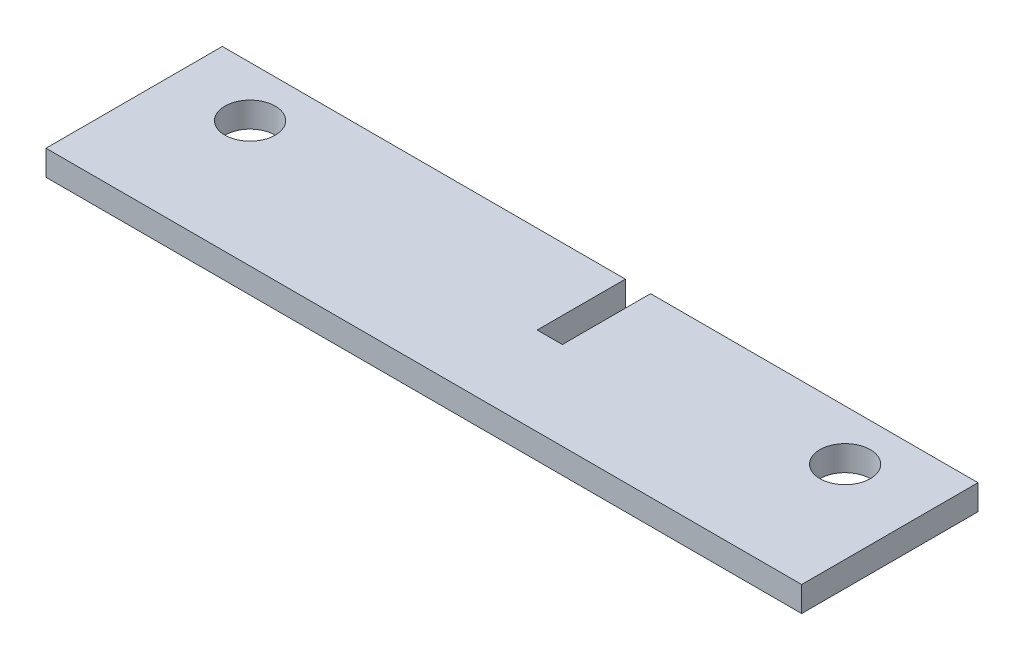
ISO-10303-21;
HEADER;
FILE_DESCRIPTION(('STEP AP214'),'2;1');
FILE_NAME('part.step','',(''),(''),'','','');
FILE_SCHEMA(('AUTOMOTIVE_DESIGN { 1 0 10303 214 1 1 1 1 }'));
ENDSEC;
DATA;
#1=APPLICATION_CONTEXT('core data for automotive mechanical design processes');
#2=APPLICATION_PROTOCOL_DEFINITION('international standard','automotive_design',2000,#1);
#3=PRODUCT_CONTEXT('',#1,'mechanical');
#4=PRODUCT('Part','Part','',(#3));
#5=PRODUCT_RELATED_PRODUCT_CATEGORY('part','',(#4));
#6=PRODUCT_DEFINITION_FORMATION('','',#4);
#7=PRODUCT_DEFINITION_CONTEXT('part definition',#1,'design');
#8=PRODUCT_DEFINITION('design','',#6,#7);
#9=PRODUCT_DEFINITION_SHAPE('','',#8);
#10=(LENGTH_UNIT() NAMED_UNIT(*) SI_UNIT(.MILLI.,.METRE.));
#11=(NAMED_UNIT(*) PLANE_ANGLE_UNIT() SI_UNIT($,.RADIAN.));
#12=(NAMED_UNIT(*) SI_UNIT($,.STERADIAN.) SOLID_ANGLE_UNIT());
#13=UNCERTAINTY_MEASURE_WITH_UNIT(LENGTH_MEASURE(1.E-05),#10,'distance_accuracy_value','');
#14=(GEOMETRIC_REPRESENTATION_CONTEXT(3) GLOBAL_UNCERTAINTY_ASSIGNED_CONTEXT((#13)) GLOBAL_UNIT_ASSIGNED_CONTEXT((#10,
#11,#12)) REPRESENTATION_CONTEXT('',''));
#15=CARTESIAN_POINT('',(0.,0.,0.));
#16=DIRECTION('',(0.,0.,1.));
#17=DIRECTION('',(1.,0.,0.));
#18=AXIS2_PLACEMENT_3D('',#15,#16,#17);
#19=CARTESIAN_POINT('',(0.,0.,249.6));
#20=DIRECTION('',(0.,0.,-1.));
#21=DIRECTION('',(-1.,0.,0.));
#22=AXIS2_PLACEMENT_3D('',#19,#20,#21);
#23=PLANE('',#22);
#24=DIRECTION('',(0.,1.,0.));
#25=VECTOR('',#24,1.);
#26=CARTESIAN_POINT('',(2476.5,115.8,249.6));
#27=LINE('',#26,#25);
#28=CARTESIAN_POINT('',(2476.5,115.8,249.6));
#29=VERTEX_POINT('',#28);
#30=CARTESIAN_POINT('',(2476.5,128.5,249.6));
#31=VERTEX_POINT('',#30);
#32=EDGE_CURVE('E142',#29,#31,#27,.T.);
#33=ORIENTED_EDGE('',*,*,#32,.T.);
#34=DIRECTION('',(-1.,0.,0.));
#35=VECTOR('',#34,1.);
#36=CARTESIAN_POINT('',(2260.6,128.5,249.6));
#37=LINE('',#36,#35);
#38=CARTESIAN_POINT('',(2641.6,128.5,249.6));
#39=VERTEX_POINT('',#38);
#40=EDGE_CURVE('E121',#39,#31,#37,.T.);
#41=ORIENTED_EDGE('',*,*,#40,.F.);
#42=DIRECTION('',(0.,1.,0.));
#43=VECTOR('',#42,1.);
#44=CARTESIAN_POINT('',(2641.6,115.8,249.6));
#45=LINE('',#44,#43);
#46=CARTESIAN_POINT('',(2641.6,115.8,249.6));
#47=VERTEX_POINT('',#46);
#48=EDGE_CURVE('E205',#47,#39,#45,.T.);
#49=ORIENTED_EDGE('',*,*,#48,.F.);
#50=DIRECTION('',(1.,0.,0.));
#51=VECTOR('',#50,1.);
#52=CARTESIAN_POINT('',(2260.6,115.8,249.6));
#53=LINE('',#52,#51);
#54=EDGE_CURVE('E181',#29,#47,#53,.T.);
#55=ORIENTED_EDGE('',*,*,#54,.F.);
#56=EDGE_LOOP('',(#33,#41,#49,#55));
#57=FACE_BOUND('',#56,.T.);
#58=ADVANCED_FACE('F43',(#57),#23,.T.);
#59=CARTESIAN_POINT('',(2260.6,115.8,249.6));
#60=DIRECTION('',(-1.,0.,0.));
#61=DIRECTION('',(0.,0.,1.));
#62=AXIS2_PLACEMENT_3D('',#59,#60,#61);
#63=PLANE('',#62);
#64=DIRECTION('',(0.,0.,1.));
#65=VECTOR('',#64,1.);
#66=CARTESIAN_POINT('',(2260.6,115.8,249.6));
#67=LINE('',#66,#65);
#68=CARTESIAN_POINT('',(2260.6,115.8,249.6));
#69=VERTEX_POINT('',#68);
#70=CARTESIAN_POINT('',(2260.6,115.8,338.5));
#71=VERTEX_POINT('',#70);
#72=EDGE_CURVE('E137',#69,#71,#67,.T.);
#73=ORIENTED_EDGE('',*,*,#72,.T.);
#74=DIRECTION('',(0.,-1.,0.));
#75=VECTOR('',#74,1.);
#76=CARTESIAN_POINT('',(2260.6,115.8,338.5));
#77=LINE('',#76,#75);
#78=CARTESIAN_POINT('',(2260.6,128.5,338.5));
#79=VERTEX_POINT('',#78);
#80=EDGE_CURVE('E128',#79,#71,#77,.T.);
#81=ORIENTED_EDGE('',*,*,#80,.F.);
#82=DIRECTION('',(0.,0.,1.));
#83=VECTOR('',#82,1.);
#84=CARTESIAN_POINT('',(2260.6,128.5,249.6));
#85=LINE('',#84,#83);
#86=CARTESIAN_POINT('',(2260.6,128.5,249.6));
#87=VERTEX_POINT('',#86);
#88=EDGE_CURVE('E114',#87,#79,#85,.T.);
#89=ORIENTED_EDGE('',*,*,#88,.F.);
#90=DIRECTION('',(0.,-1.,0.));
#91=VECTOR('',#90,1.);
#92=CARTESIAN_POINT('',(2260.6,115.8,249.6));
#93=LINE('',#92,#91);
#94=EDGE_CURVE('E126',#87,#69,#93,.T.);
#95=ORIENTED_EDGE('',*,*,#94,.T.);
#96=EDGE_LOOP('',(#73,#81,#89,#95));
#97=FACE_BOUND('',#96,.T.);
#98=ADVANCED_FACE('F125',(#97),#63,.T.);
#99=CARTESIAN_POINT('',(2260.6,128.5,249.6));
#100=DIRECTION('',(0.,1.,0.));
#101=DIRECTION('',(0.,0.,1.));
#102=AXIS2_PLACEMENT_3D('',#99,#100,#101);
#103=PLANE('',#102);
#104=CARTESIAN_POINT('',(2599.99999999996,128.5,275.));
#105=DIRECTION('',(0.,1.,0.));
#106=DIRECTION('',(0.,0.,1.));
#107=AXIS2_PLACEMENT_3D('',#104,#105,#106);
#108=CIRCLE('',#107,12.6999999999999);
#109=CARTESIAN_POINT('',(2599.99999999996,128.5,262.3));
#110=VERTEX_POINT('',#109);
#111=EDGE_CURVE('E136',#110,#110,#108,.F.);
#112=ORIENTED_EDGE('',*,*,#111,.T.);
#113=EDGE_LOOP('',(#112));
#114=FACE_BOUND('',#113,.T.);
#115=CARTESIAN_POINT('',(2299.99999999996,128.5,275.));
#116=DIRECTION('',(0.,1.,0.));
#117=DIRECTION('',(0.,0.,1.));
#118=AXIS2_PLACEMENT_3D('',#115,#116,#117);
#119=CIRCLE('',#118,12.6999999999999);
#120=CARTESIAN_POINT('',(2299.99999999996,128.5,262.3));
#121=VERTEX_POINT('',#120);
#122=EDGE_CURVE('E47',#121,#121,#119,.F.);
#123=ORIENTED_EDGE('',*,*,#122,.T.);
#124=EDGE_LOOP('',(#123));
#125=FACE_BOUND('',#124,.T.);
#126=DIRECTION('',(0.,0.,-1.));
#127=VECTOR('',#126,1.);
#128=CARTESIAN_POINT('',(2476.5,128.5,249.6));
#129=LINE('',#128,#127);
#130=CARTESIAN_POINT('',(2476.5,128.5,294.05));
#131=VERTEX_POINT('',#130);
#132=EDGE_CURVE('E150',#131,#31,#129,.T.);
#133=ORIENTED_EDGE('',*,*,#132,.F.);
#134=DIRECTION('',(1.,0.,0.));
#135=VECTOR('',#134,1.);
#136=CARTESIAN_POINT('',(2476.5,128.5,294.05));
#137=LINE('',#136,#135);
#138=CARTESIAN_POINT('',(2463.8,128.5,294.05));
#139=VERTEX_POINT('',#138);
#140=EDGE_CURVE('E165',#139,#131,#137,.T.);
#141=ORIENTED_EDGE('',*,*,#140,.F.);
#142=DIRECTION('',(0.,0.,1.));
#143=VECTOR('',#142,1.);
#144=CARTESIAN_POINT('',(2463.8,128.5,294.05));
#145=LINE('',#144,#143);
#146=CARTESIAN_POINT('',(2463.8,128.5,249.6));
#147=VERTEX_POINT('',#146);
#148=EDGE_CURVE('E54',#147,#139,#145,.T.);
#149=ORIENTED_EDGE('',*,*,#148,.F.);
#150=EDGE_CURVE('E110',#147,#87,#37,.T.);
#151=ORIENTED_EDGE('',*,*,#150,.T.);
#152=ORIENTED_EDGE('',*,*,#88,.T.);
#153=DIRECTION('',(-1.,0.,0.));
#154=VECTOR('',#153,1.);
#155=CARTESIAN_POINT('',(2260.6,128.5,338.5));
#156=LINE('',#155,#154);
#157=CARTESIAN_POINT('',(2641.6,128.5,338.5));
#158=VERTEX_POINT('',#157);
#159=EDGE_CURVE('E147',#158,#79,#156,.T.);
#160=ORIENTED_EDGE('',*,*,#159,.F.);
#161=DIRECTION('',(0.,0.,1.));
#162=VECTOR('',#161,1.);
#163=CARTESIAN_POINT('',(2641.6,128.5,249.6));
#164=LINE('',#163,#162);
#165=EDGE_CURVE('E210',#39,#158,#164,.T.);
#166=ORIENTED_EDGE('',*,*,#165,.F.);
#167=ORIENTED_EDGE('',*,*,#40,.T.);
#168=EDGE_LOOP('',(#133,#141,#149,#151,#152,#160,#166,#167));
#169=FACE_BOUND('',#168,.T.);
#170=ADVANCED_FACE('F45',(#114,#125,#169),#103,.T.);
#171=CARTESIAN_POINT('',(2641.6,115.8,249.6));
#172=DIRECTION('',(1.,0.,0.));
#173=DIRECTION('',(0.,0.,-1.));
#174=AXIS2_PLACEMENT_3D('',#171,#172,#173);
#175=PLANE('',#174);
#176=ORIENTED_EDGE('',*,*,#165,.T.);
#177=DIRECTION('',(0.,1.,0.));
#178=VECTOR('',#177,1.);
#179=CARTESIAN_POINT('',(2641.6,115.8,338.5));
#180=LINE('',#179,#178);
#181=CARTESIAN_POINT('',(2641.6,115.8,338.5));
#182=VERTEX_POINT('',#181);
#183=EDGE_CURVE('E151',#182,#158,#180,.T.);
#184=ORIENTED_EDGE('',*,*,#183,.F.);
#185=DIRECTION('',(0.,0.,1.));
#186=VECTOR('',#185,1.);
#187=CARTESIAN_POINT('',(2641.6,115.8,249.6));
#188=LINE('',#187,#186);
#189=EDGE_CURVE('E191',#47,#182,#188,.T.);
#190=ORIENTED_EDGE('',*,*,#189,.F.);
#191=ORIENTED_EDGE('',*,*,#48,.T.);
#192=EDGE_LOOP('',(#176,#184,#190,#191));
#193=FACE_BOUND('',#192,.T.);
#194=ADVANCED_FACE('F204',(#193),#175,.T.);
#195=CARTESIAN_POINT('',(2260.6,115.8,249.6));
#196=DIRECTION('',(0.,-1.,0.));
#197=DIRECTION('',(0.,0.,-1.));
#198=AXIS2_PLACEMENT_3D('',#195,#196,#197);
#199=PLANE('',#198);
#200=CARTESIAN_POINT('',(2599.99999999996,115.8,275.));
#201=DIRECTION('',(0.,-1.,0.));
#202=DIRECTION('',(0.,0.,-1.));
#203=AXIS2_PLACEMENT_3D('',#200,#201,#202);
#204=CIRCLE('',#203,12.6999999999999);
#205=CARTESIAN_POINT('',(2599.99999999996,115.8,262.3));
#206=VERTEX_POINT('',#205);
#207=EDGE_CURVE('E209',#206,#206,#204,.F.);
#208=ORIENTED_EDGE('',*,*,#207,.T.);
#209=EDGE_LOOP('',(#208));
#210=FACE_BOUND('',#209,.T.);
#211=CARTESIAN_POINT('',(2299.99999999996,115.8,275.));
#212=DIRECTION('',(0.,-1.,0.));
#213=DIRECTION('',(0.,0.,-1.));
#214=AXIS2_PLACEMENT_3D('',#211,#212,#213);
#215=CIRCLE('',#214,12.6999999999999);
#216=CARTESIAN_POINT('',(2299.99999999996,115.8,262.3));
#217=VERTEX_POINT('',#216);
#218=EDGE_CURVE('E182',#217,#217,#215,.F.);
#219=ORIENTED_EDGE('',*,*,#218,.T.);
#220=EDGE_LOOP('',(#219));
#221=FACE_BOUND('',#220,.T.);
#222=DIRECTION('',(0.,0.,-1.));
#223=VECTOR('',#222,1.);
#224=CARTESIAN_POINT('',(2476.5,115.8,249.6));
#225=LINE('',#224,#223);
#226=CARTESIAN_POINT('',(2476.5,115.8,294.05));
#227=VERTEX_POINT('',#226);
#228=EDGE_CURVE('E177',#227,#29,#225,.T.);
#229=ORIENTED_EDGE('',*,*,#228,.T.);
#230=ORIENTED_EDGE('',*,*,#54,.T.);
#231=ORIENTED_EDGE('',*,*,#189,.T.);
#232=DIRECTION('',(1.,0.,0.));
#233=VECTOR('',#232,1.);
#234=CARTESIAN_POINT('',(2260.6,115.8,338.5));
#235=LINE('',#234,#233);
#236=EDGE_CURVE('E155',#71,#182,#235,.T.);
#237=ORIENTED_EDGE('',*,*,#236,.F.);
#238=ORIENTED_EDGE('',*,*,#72,.F.);
#239=CARTESIAN_POINT('',(2463.8,115.8,249.6));
#240=VERTEX_POINT('',#239);
#241=EDGE_CURVE('E134',#69,#240,#53,.T.);
#242=ORIENTED_EDGE('',*,*,#241,.T.);
#243=DIRECTION('',(0.,0.,1.));
#244=VECTOR('',#243,1.);
#245=CARTESIAN_POINT('',(2463.8,115.8,294.05));
#246=LINE('',#245,#244);
#247=CARTESIAN_POINT('',(2463.8,115.8,294.05));
#248=VERTEX_POINT('',#247);
#249=EDGE_CURVE('E186',#240,#248,#246,.T.);
#250=ORIENTED_EDGE('',*,*,#249,.T.);
#251=DIRECTION('',(1.,0.,0.));
#252=VECTOR('',#251,1.);
#253=CARTESIAN_POINT('',(2476.5,115.8,294.05));
#254=LINE('',#253,#252);
#255=EDGE_CURVE('E160',#248,#227,#254,.T.);
#256=ORIENTED_EDGE('',*,*,#255,.T.);
#257=EDGE_LOOP('',(#229,#230,#231,#237,#238,#242,#250,#256));
#258=FACE_BOUND('',#257,.T.);
#259=ADVANCED_FACE('F197',(#210,#221,#258),#199,.T.);
#260=DIRECTION('',(0.,1.,0.));
#261=VECTOR('',#260,1.);
#262=CARTESIAN_POINT('',(2463.8,115.8,249.6));
#263=LINE('',#262,#261);
#264=EDGE_CURVE('E11',#240,#147,#263,.T.);
#265=ORIENTED_EDGE('',*,*,#264,.F.);
#266=ORIENTED_EDGE('',*,*,#241,.F.);
#267=ORIENTED_EDGE('',*,*,#94,.F.);
#268=ORIENTED_EDGE('',*,*,#150,.F.);
#269=EDGE_LOOP('',(#265,#266,#267,#268));
#270=FACE_BOUND('',#269,.T.);
#271=ADVANCED_FACE('F132',(#270),#23,.T.);
#272=CARTESIAN_POINT('',(0.,0.,338.5));
#273=DIRECTION('',(0.,0.,-1.));
#274=DIRECTION('',(-1.,0.,0.));
#275=AXIS2_PLACEMENT_3D('',#272,#273,#274);
#276=PLANE('',#275);
#277=ORIENTED_EDGE('',*,*,#80,.T.);
#278=ORIENTED_EDGE('',*,*,#236,.T.);
#279=ORIENTED_EDGE('',*,*,#183,.T.);
#280=ORIENTED_EDGE('',*,*,#159,.T.);
#281=EDGE_LOOP('',(#277,#278,#279,#280));
#282=FACE_BOUND('',#281,.T.);
#283=ADVANCED_FACE('F247',(#282),#276,.F.);
#284=CARTESIAN_POINT('',(2476.5,115.8,249.6));
#285=DIRECTION('',(1.,0.,0.));
#286=DIRECTION('',(0.,0.,-1.));
#287=AXIS2_PLACEMENT_3D('',#284,#285,#286);
#288=PLANE('',#287);
#289=ORIENTED_EDGE('',*,*,#132,.T.);
#290=ORIENTED_EDGE('',*,*,#32,.F.);
#291=ORIENTED_EDGE('',*,*,#228,.F.);
#292=DIRECTION('',(0.,1.,0.));
#293=VECTOR('',#292,1.);
#294=CARTESIAN_POINT('',(2476.5,115.8,294.05));
#295=LINE('',#294,#293);
#296=EDGE_CURVE('E78',#227,#131,#295,.T.);
#297=ORIENTED_EDGE('',*,*,#296,.T.);
#298=EDGE_LOOP('',(#289,#290,#291,#297));
#299=FACE_BOUND('',#298,.T.);
#300=ADVANCED_FACE('F252',(#299),#288,.F.);
#301=CARTESIAN_POINT('',(2476.5,115.8,294.05));
#302=DIRECTION('',(0.,0.,1.));
#303=DIRECTION('',(1.,0.,0.));
#304=AXIS2_PLACEMENT_3D('',#301,#302,#303);
#305=PLANE('',#304);
#306=ORIENTED_EDGE('',*,*,#140,.T.);
#307=ORIENTED_EDGE('',*,*,#296,.F.);
#308=ORIENTED_EDGE('',*,*,#255,.F.);
#309=DIRECTION('',(0.,1.,0.));
#310=VECTOR('',#309,1.);
#311=CARTESIAN_POINT('',(2463.8,115.8,294.05));
#312=LINE('',#311,#310);
#313=EDGE_CURVE('E162',#248,#139,#312,.T.);
#314=ORIENTED_EDGE('',*,*,#313,.T.);
#315=EDGE_LOOP('',(#306,#307,#308,#314));
#316=FACE_BOUND('',#315,.T.);
#317=ADVANCED_FACE('F235',(#316),#305,.F.);
#318=CARTESIAN_POINT('',(2463.8,115.8,294.05));
#319=DIRECTION('',(-1.,0.,0.));
#320=DIRECTION('',(0.,0.,1.));
#321=AXIS2_PLACEMENT_3D('',#318,#319,#320);
#322=PLANE('',#321);
#323=ORIENTED_EDGE('',*,*,#148,.T.);
#324=ORIENTED_EDGE('',*,*,#313,.F.);
#325=ORIENTED_EDGE('',*,*,#249,.F.);
#326=ORIENTED_EDGE('',*,*,#264,.T.);
#327=EDGE_LOOP('',(#323,#324,#325,#326));
#328=FACE_BOUND('',#327,.T.);
#329=ADVANCED_FACE('F226',(#328),#322,.F.);
#330=CARTESIAN_POINT('',(2299.99999999996,181.249999999996,275.));
#331=DIRECTION('',(0.,-1.,0.));
#332=DIRECTION('',(0.,0.,-1.));
#333=AXIS2_PLACEMENT_3D('',#330,#331,#332);
#334=CYLINDRICAL_SURFACE('',#333,12.6999999999999);
#335=CARTESIAN_POINT('',(2299.99999999996,128.5,262.3));
#336=CARTESIAN_POINT('',(2299.99999999996,128.367708333333,262.3));
#337=CARTESIAN_POINT('',(2299.99999999996,128.235416666667,262.3));
#338=CARTESIAN_POINT('',(2299.99999999996,127.970833333333,262.3));
#339=CARTESIAN_POINT('',(2299.99999999996,127.838541666667,262.3));
#340=CARTESIAN_POINT('',(2299.99999999996,127.573958333333,262.3));
#341=CARTESIAN_POINT('',(2299.99999999996,127.441666666667,262.3));
#342=CARTESIAN_POINT('',(2299.99999999996,127.177083333333,262.3));
#343=CARTESIAN_POINT('',(2299.99999999996,127.044791666667,262.3));
#344=CARTESIAN_POINT('',(2299.99999999996,126.780208333333,262.3));
#345=CARTESIAN_POINT('',(2299.99999999996,126.647916666667,262.3));
#346=CARTESIAN_POINT('',(2299.99999999996,126.383333333333,262.3));
#347=CARTESIAN_POINT('',(2299.99999999996,126.251041666667,262.3));
#348=CARTESIAN_POINT('',(2299.99999999996,125.986458333333,262.3));
#349=CARTESIAN_POINT('',(2299.99999999996,125.854166666667,262.3));
#350=CARTESIAN_POINT('',(2299.99999999996,125.589583333333,262.3));
#351=CARTESIAN_POINT('',(2299.99999999996,125.457291666667,262.3));
#352=CARTESIAN_POINT('',(2299.99999999996,125.192708333333,262.3));
#353=CARTESIAN_POINT('',(2299.99999999996,125.060416666667,262.3));
#354=CARTESIAN_POINT('',(2299.99999999996,124.795833333333,262.3));
#355=CARTESIAN_POINT('',(2299.99999999996,124.663541666667,262.3));
#356=CARTESIAN_POINT('',(2299.99999999996,124.398958333333,262.3));
#357=CARTESIAN_POINT('',(2299.99999999996,124.266666666667,262.3));
#358=CARTESIAN_POINT('',(2299.99999999996,124.002083333333,262.3));
#359=CARTESIAN_POINT('',(2299.99999999996,123.869791666667,262.3));
#360=CARTESIAN_POINT('',(2299.99999999996,123.605208333333,262.3));
#361=CARTESIAN_POINT('',(2299.99999999996,123.472916666667,262.3));
#362=CARTESIAN_POINT('',(2299.99999999996,123.208333333333,262.3));
#363=CARTESIAN_POINT('',(2299.99999999996,123.076041666667,262.3));
#364=CARTESIAN_POINT('',(2299.99999999996,122.811458333333,262.3));
#365=CARTESIAN_POINT('',(2299.99999999996,122.679166666667,262.3));
#366=CARTESIAN_POINT('',(2299.99999999996,122.414583333333,262.3));
#367=CARTESIAN_POINT('',(2299.99999999996,122.282291666667,262.3));
#368=CARTESIAN_POINT('',(2299.99999999996,122.017708333333,262.3));
#369=CARTESIAN_POINT('',(2299.99999999996,121.885416666667,262.3));
#370=CARTESIAN_POINT('',(2299.99999999996,121.620833333333,262.3));
#371=CARTESIAN_POINT('',(2299.99999999996,121.488541666667,262.3));
#372=CARTESIAN_POINT('',(2299.99999999996,121.223958333333,262.3));
#373=CARTESIAN_POINT('',(2299.99999999996,121.091666666667,262.3));
#374=CARTESIAN_POINT('',(2299.99999999996,120.827083333333,262.3));
#375=CARTESIAN_POINT('',(2299.99999999996,120.694791666667,262.3));
#376=CARTESIAN_POINT('',(2299.99999999996,120.430208333333,262.3));
#377=CARTESIAN_POINT('',(2299.99999999996,120.297916666667,262.3));
#378=CARTESIAN_POINT('',(2299.99999999996,120.033333333333,262.3));
#379=CARTESIAN_POINT('',(2299.99999999996,119.901041666667,262.3));
#380=CARTESIAN_POINT('',(2299.99999999996,119.636458333333,262.3));
#381=CARTESIAN_POINT('',(2299.99999999996,119.504166666667,262.3));
#382=CARTESIAN_POINT('',(2299.99999999996,119.239583333333,262.3));
#383=CARTESIAN_POINT('',(2299.99999999996,119.107291666667,262.3));
#384=CARTESIAN_POINT('',(2299.99999999996,118.842708333333,262.3));
#385=CARTESIAN_POINT('',(2299.99999999996,118.710416666667,262.3));
#386=CARTESIAN_POINT('',(2299.99999999996,118.445833333333,262.3));
#387=CARTESIAN_POINT('',(2299.99999999996,118.313541666667,262.3));
#388=CARTESIAN_POINT('',(2299.99999999996,118.048958333333,262.3));
#389=CARTESIAN_POINT('',(2299.99999999996,117.916666666667,262.3));
#390=CARTESIAN_POINT('',(2299.99999999996,117.652083333333,262.3));
#391=CARTESIAN_POINT('',(2299.99999999996,117.519791666667,262.3));
#392=CARTESIAN_POINT('',(2299.99999999996,117.255208333333,262.3));
#393=CARTESIAN_POINT('',(2299.99999999996,117.122916666667,262.3));
#394=CARTESIAN_POINT('',(2299.99999999996,116.858333333333,262.3));
#395=CARTESIAN_POINT('',(2299.99999999996,116.726041666667,262.3));
#396=CARTESIAN_POINT('',(2299.99999999996,116.461458333333,262.3));
#397=CARTESIAN_POINT('',(2299.99999999996,116.329166666667,262.3));
#398=CARTESIAN_POINT('',(2299.99999999996,116.064583333333,262.3));
#399=CARTESIAN_POINT('',(2299.99999999996,115.932291666667,262.3));
#400=CARTESIAN_POINT('',(2299.99999999996,115.8,262.3));
#401=B_SPLINE_CURVE_WITH_KNOTS('',3,(#335,#336,#337,#338,#339,#340,#341,#342,#343,#344,#345,
#346,#347,#348,#349,#350,#351,#352,#353,#354,#355,#356,#357,#358,#359,#360,#361,#362,#363,#364,
#365,#366,#367,#368,#369,#370,#371,#372,#373,#374,#375,#376,#377,#378,#379,#380,#381,#382,#383,
#384,#385,#386,#387,#388,#389,#390,#391,#392,#393,#394,#395,#396,#397,#398,#399,#400),
.UNSPECIFIED.,.F.,.F.,(4,2,2,2,2,2,2,2,2,2,2,2,2,2,2,2,2,2,2,2,2,2,2,2,2,2,2,2,2,2,2,2,4),(0.,
0.396874999999991,0.793749999999982,1.190625,1.58749999999999,1.98437499999998,2.38124999999997,
2.77812499999996,3.17499999999998,3.57187499999997,3.96874999999998,4.36562499999998,
4.76249999999998,5.15937499999998,5.55624999999998,5.95312499999998,6.34999999999997,
6.74687499999997,7.14374999999998,7.54062499999997,7.93749999999997,8.33437499999998,
8.73124999999997,9.12812499999996,9.52499999999996,9.92187499999997,10.31875,10.715625,11.1125,
11.509375,11.90625,12.303125,12.7),.UNSPECIFIED.);
#402=EDGE_CURVE('BSEAM223',#121,#217,#401,.T.);
#403=ORIENTED_EDGE('',*,*,#122,.F.);
#404=ORIENTED_EDGE('',*,*,#218,.F.);
#405=ORIENTED_EDGE('',*,*,#402,.T.);
#406=ORIENTED_EDGE('',*,*,#402,.F.);
#407=EDGE_LOOP('',(#403,#405,#404,#406));
#408=FACE_BOUND('',#407,.T.);
#409=ADVANCED_FACE('F223',(#408),#334,.F.);
#410=CARTESIAN_POINT('',(2599.99999999996,289.999999999996,275.));
#411=DIRECTION('',(0.,-1.,0.));
#412=DIRECTION('',(0.,0.,-1.));
#413=AXIS2_PLACEMENT_3D('',#410,#411,#412);
#414=CYLINDRICAL_SURFACE('',#413,12.6999999999999);
#415=CARTESIAN_POINT('',(2599.99999999996,128.5,262.3));
#416=CARTESIAN_POINT('',(2599.99999999996,128.367708333333,262.3));
#417=CARTESIAN_POINT('',(2599.99999999996,128.235416666667,262.3));
#418=CARTESIAN_POINT('',(2599.99999999996,127.970833333333,262.3));
#419=CARTESIAN_POINT('',(2599.99999999996,127.838541666667,262.3));
#420=CARTESIAN_POINT('',(2599.99999999996,127.573958333333,262.3));
#421=CARTESIAN_POINT('',(2599.99999999996,127.441666666667,262.3));
#422=CARTESIAN_POINT('',(2599.99999999996,127.177083333333,262.3));
#423=CARTESIAN_POINT('',(2599.99999999996,127.044791666667,262.3));
#424=CARTESIAN_POINT('',(2599.99999999996,126.780208333333,262.3));
#425=CARTESIAN_POINT('',(2599.99999999996,126.647916666667,262.3));
#426=CARTESIAN_POINT('',(2599.99999999996,126.383333333333,262.3));
#427=CARTESIAN_POINT('',(2599.99999999996,126.251041666667,262.3));
#428=CARTESIAN_POINT('',(2599.99999999996,125.986458333333,262.3));
#429=CARTESIAN_POINT('',(2599.99999999996,125.854166666667,262.3));
#430=CARTESIAN_POINT('',(2599.99999999996,125.589583333333,262.3));
#431=CARTESIAN_POINT('',(2599.99999999996,125.457291666667,262.3));
#432=CARTESIAN_POINT('',(2599.99999999996,125.192708333333,262.3));
#433=CARTESIAN_POINT('',(2599.99999999996,125.060416666667,262.3));
#434=CARTESIAN_POINT('',(2599.99999999996,124.795833333333,262.3));
#435=CARTESIAN_POINT('',(2599.99999999996,124.663541666667,262.3));
#436=CARTESIAN_POINT('',(2599.99999999996,124.398958333333,262.3));
#437=CARTESIAN_POINT('',(2599.99999999996,124.266666666667,262.3));
#438=CARTESIAN_POINT('',(2599.99999999996,124.002083333333,262.3));
#439=CARTESIAN_POINT('',(2599.99999999996,123.869791666667,262.3));
#440=CARTESIAN_POINT('',(2599.99999999996,123.605208333333,262.3));
#441=CARTESIAN_POINT('',(2599.99999999996,123.472916666667,262.3));
#442=CARTESIAN_POINT('',(2599.99999999996,123.208333333333,262.3));
#443=CARTESIAN_POINT('',(2599.99999999996,123.076041666667,262.3));
#444=CARTESIAN_POINT('',(2599.99999999996,122.811458333333,262.3));
#445=CARTESIAN_POINT('',(2599.99999999996,122.679166666667,262.3));
#446=CARTESIAN_POINT('',(2599.99999999996,122.414583333333,262.3));
#447=CARTESIAN_POINT('',(2599.99999999996,122.282291666667,262.3));
#448=CARTESIAN_POINT('',(2599.99999999996,122.017708333333,262.3));
#449=CARTESIAN_POINT('',(2599.99999999996,121.885416666667,262.3));
#450=CARTESIAN_POINT('',(2599.99999999996,121.620833333333,262.3));
#451=CARTESIAN_POINT('',(2599.99999999996,121.488541666667,262.3));
#452=CARTESIAN_POINT('',(2599.99999999996,121.223958333333,262.3));
#453=CARTESIAN_POINT('',(2599.99999999996,121.091666666667,262.3));
#454=CARTESIAN_POINT('',(2599.99999999996,120.827083333333,262.3));
#455=CARTESIAN_POINT('',(2599.99999999996,120.694791666667,262.3));
#456=CARTESIAN_POINT('',(2599.99999999996,120.430208333333,262.3));
#457=CARTESIAN_POINT('',(2599.99999999996,120.297916666667,262.3));
#458=CARTESIAN_POINT('',(2599.99999999996,120.033333333333,262.3));
#459=CARTESIAN_POINT('',(2599.99999999996,119.901041666667,262.3));
#460=CARTESIAN_POINT('',(2599.99999999996,119.636458333333,262.3));
#461=CARTESIAN_POINT('',(2599.99999999996,119.504166666667,262.3));
#462=CARTESIAN_POINT('',(2599.99999999996,119.239583333333,262.3));
#463=CARTESIAN_POINT('',(2599.99999999996,119.107291666667,262.3));
#464=CARTESIAN_POINT('',(2599.99999999996,118.842708333333,262.3));
#465=CARTESIAN_POINT('',(2599.99999999996,118.710416666667,262.3));
#466=CARTESIAN_POINT('',(2599.99999999996,118.445833333333,262.3));
#467=CARTESIAN_POINT('',(2599.99999999996,118.313541666667,262.3));
#468=CARTESIAN_POINT('',(2599.99999999996,118.048958333333,262.3));
#469=CARTESIAN_POINT('',(2599.99999999996,117.916666666667,262.3));
#470=CARTESIAN_POINT('',(2599.99999999996,117.652083333333,262.3));
#471=CARTESIAN_POINT('',(2599.99999999996,117.519791666667,262.3));
#472=CARTESIAN_POINT('',(2599.99999999996,117.255208333333,262.3));
#473=CARTESIAN_POINT('',(2599.99999999996,117.122916666667,262.3));
#474=CARTESIAN_POINT('',(2599.99999999996,116.858333333333,262.3));
#475=CARTESIAN_POINT('',(2599.99999999996,116.726041666667,262.3));
#476=CARTESIAN_POINT('',(2599.99999999996,116.461458333333,262.3));
#477=CARTESIAN_POINT('',(2599.99999999996,116.329166666667,262.3));
#478=CARTESIAN_POINT('',(2599.99999999996,116.064583333333,262.3));
#479=CARTESIAN_POINT('',(2599.99999999996,115.932291666667,262.3));
#480=CARTESIAN_POINT('',(2599.99999999996,115.8,262.3));
#481=B_SPLINE_CURVE_WITH_KNOTS('',3,(#415,#416,#417,#418,#419,#420,#421,#422,#423,#424,#425,
#426,#427,#428,#429,#430,#431,#432,#433,#434,#435,#436,#437,#438,#439,#440,#441,#442,#443,#444,
#445,#446,#447,#448,#449,#450,#451,#452,#453,#454,#455,#456,#457,#458,#459,#460,#461,#462,#463,
#464,#465,#466,#467,#468,#469,#470,#471,#472,#473,#474,#475,#476,#477,#478,#479,#480),
.UNSPECIFIED.,.F.,.F.,(4,2,2,2,2,2,2,2,2,2,2,2,2,2,2,2,2,2,2,2,2,2,2,2,2,2,2,2,2,2,2,2,4),(0.,
0.396874999999991,0.79375000000001,1.190625,1.58749999999999,1.98437500000001,2.38125,
2.77812499999999,3.17499999999998,3.571875,3.96874999999999,4.36562499999998,4.7625,
5.15937499999999,5.55624999999998,5.953125,6.34999999999999,6.74687499999999,7.14375,7.540625,
7.93749999999999,8.334375,8.73125,9.12812499999999,9.52500000000001,9.921875,10.31875,10.715625,
11.1125,11.509375,11.90625,12.303125,12.7),.UNSPECIFIED.);
#482=EDGE_CURVE('BSEAM225',#110,#206,#481,.T.);
#483=ORIENTED_EDGE('',*,*,#111,.F.);
#484=ORIENTED_EDGE('',*,*,#207,.F.);
#485=ORIENTED_EDGE('',*,*,#482,.T.);
#486=ORIENTED_EDGE('',*,*,#482,.F.);
#487=EDGE_LOOP('',(#483,#485,#484,#486));
#488=FACE_BOUND('',#487,.T.);
#489=ADVANCED_FACE('F225',(#488),#414,.F.);
#490=CLOSED_SHELL('',(#58,#98,#170,#194,#259,#271,#283,#300,#317,#329,#409,#489));
#491=MANIFOLD_SOLID_BREP('B2',#490);
#492=ADVANCED_BREP_SHAPE_REPRESENTATION('',(#18,#491),#14);
#493=SHAPE_DEFINITION_REPRESENTATION(#9,#492);
ENDSEC;
END-ISO-10303-21;
